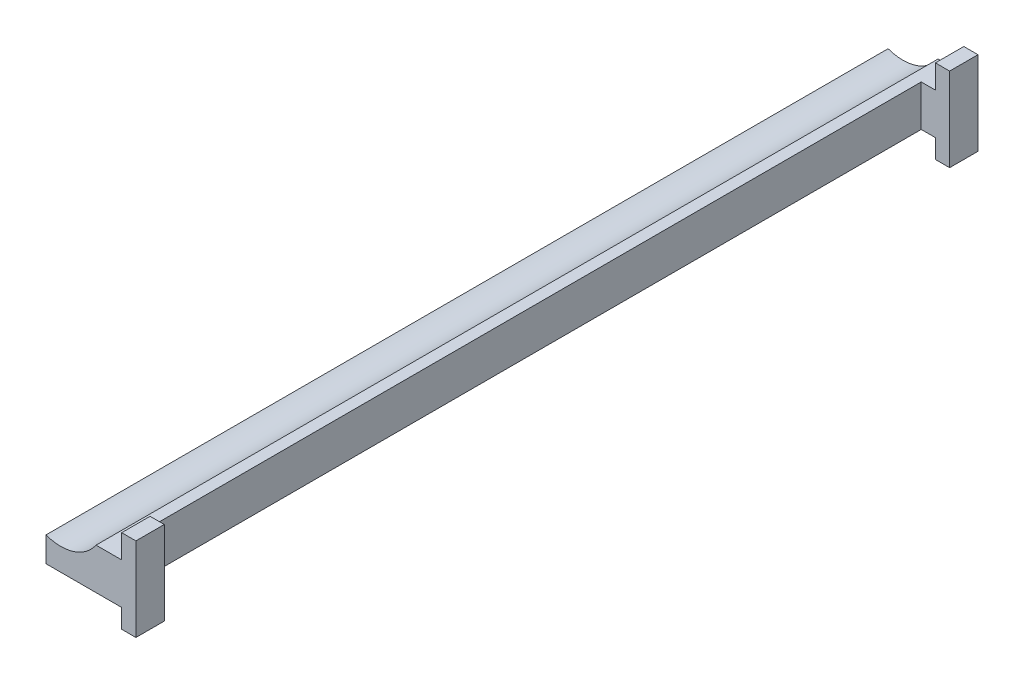
ISO-10303-21;
HEADER;
FILE_DESCRIPTION(('STEP AP214'),'2;1');
FILE_NAME('part.step','',(''),(''),'','','');
FILE_SCHEMA(('AUTOMOTIVE_DESIGN { 1 0 10303 214 1 1 1 1 }'));
ENDSEC;
DATA;
#1=APPLICATION_CONTEXT('core data for automotive mechanical design processes');
#2=APPLICATION_PROTOCOL_DEFINITION('international standard','automotive_design',2000,#1);
#3=PRODUCT_CONTEXT('',#1,'mechanical');
#4=PRODUCT('Part','Part','',(#3));
#5=PRODUCT_RELATED_PRODUCT_CATEGORY('part','',(#4));
#6=PRODUCT_DEFINITION_FORMATION('','',#4);
#7=PRODUCT_DEFINITION_CONTEXT('part definition',#1,'design');
#8=PRODUCT_DEFINITION('design','',#6,#7);
#9=PRODUCT_DEFINITION_SHAPE('','',#8);
#10=(LENGTH_UNIT() NAMED_UNIT(*) SI_UNIT(.MILLI.,.METRE.));
#11=(NAMED_UNIT(*) PLANE_ANGLE_UNIT() SI_UNIT($,.RADIAN.));
#12=(NAMED_UNIT(*) SI_UNIT($,.STERADIAN.) SOLID_ANGLE_UNIT());
#13=UNCERTAINTY_MEASURE_WITH_UNIT(LENGTH_MEASURE(1.E-05),#10,'distance_accuracy_value','');
#14=(GEOMETRIC_REPRESENTATION_CONTEXT(3) GLOBAL_UNCERTAINTY_ASSIGNED_CONTEXT((#13)) GLOBAL_UNIT_ASSIGNED_CONTEXT((#10,
#11,#12)) REPRESENTATION_CONTEXT('',''));
#15=CARTESIAN_POINT('',(0.,0.,0.));
#16=DIRECTION('',(0.,0.,1.));
#17=DIRECTION('',(1.,0.,0.));
#18=AXIS2_PLACEMENT_3D('',#15,#16,#17);
#19=CARTESIAN_POINT('',(-202.415201488574,0.,-890.));
#20=DIRECTION('',(1.,0.,0.));
#21=DIRECTION('',(0.,0.,-1.));
#22=AXIS2_PLACEMENT_3D('',#19,#20,#21);
#23=PLANE('',#22);
#24=DIRECTION('',(0.,0.,1.));
#25=VECTOR('',#24,1.);
#26=CARTESIAN_POINT('',(-202.415201488574,17.9396139522176,-890.));
#27=LINE('',#26,#25);
#28=CARTESIAN_POINT('',(-202.415201488574,17.9396139522176,-890.));
#29=VERTEX_POINT('',#28);
#30=CARTESIAN_POINT('',(-202.415201488574,17.9396139522176,-860.));
#31=VERTEX_POINT('',#30);
#32=EDGE_CURVE('E204',#29,#31,#27,.T.);
#33=ORIENTED_EDGE('',*,*,#32,.T.);
#34=DIRECTION('',(0.,1.,0.));
#35=VECTOR('',#34,1.);
#36=CARTESIAN_POINT('',(-202.415201488574,0.,-860.));
#37=LINE('',#36,#35);
#38=CARTESIAN_POINT('',(-202.415201488574,42.879994244333,-860.));
#39=VERTEX_POINT('',#38);
#40=EDGE_CURVE('E144',#31,#39,#37,.T.);
#41=ORIENTED_EDGE('',*,*,#40,.T.);
#42=DIRECTION('',(0.,0.,1.));
#43=VECTOR('',#42,1.);
#44=CARTESIAN_POINT('',(-202.415201488574,42.879994244333,-890.));
#45=LINE('',#44,#43);
#46=CARTESIAN_POINT('',(-202.415201488574,42.879994244333,-890.));
#47=VERTEX_POINT('',#46);
#48=EDGE_CURVE('E141',#47,#39,#45,.T.);
#49=ORIENTED_EDGE('',*,*,#48,.F.);
#50=DIRECTION('',(0.,1.,0.));
#51=VECTOR('',#50,1.);
#52=CARTESIAN_POINT('',(-202.415201488574,0.,-890.));
#53=LINE('',#52,#51);
#54=EDGE_CURVE('E129',#29,#47,#53,.T.);
#55=ORIENTED_EDGE('',*,*,#54,.F.);
#56=EDGE_LOOP('',(#33,#41,#49,#55));
#57=FACE_BOUND('',#56,.T.);
#58=ADVANCED_FACE('F41',(#57),#23,.F.);
#59=CARTESIAN_POINT('',(0.,42.879994244333,-890.));
#60=DIRECTION('',(0.,-1.,0.));
#61=DIRECTION('',(0.,0.,-1.));
#62=AXIS2_PLACEMENT_3D('',#59,#60,#61);
#63=PLANE('',#62);
#64=ORIENTED_EDGE('',*,*,#48,.T.);
#65=DIRECTION('',(1.,0.,0.));
#66=VECTOR('',#65,1.);
#67=CARTESIAN_POINT('',(-217.415201488574,42.879994244333,-860.));
#68=LINE('',#67,#66);
#69=CARTESIAN_POINT('',(-187.415201488574,42.879994244333,-860.));
#70=VERTEX_POINT('',#69);
#71=EDGE_CURVE('E305',#39,#70,#68,.T.);
#72=ORIENTED_EDGE('',*,*,#71,.T.);
#73=DIRECTION('',(0.,0.,1.));
#74=VECTOR('',#73,1.);
#75=CARTESIAN_POINT('',(-187.415201488574,42.879994244333,-890.));
#76=LINE('',#75,#74);
#77=CARTESIAN_POINT('',(-187.415201488574,42.879994244333,-890.));
#78=VERTEX_POINT('',#77);
#79=EDGE_CURVE('E153',#78,#70,#76,.T.);
#80=ORIENTED_EDGE('',*,*,#79,.F.);
#81=DIRECTION('',(1.,0.,0.));
#82=VECTOR('',#81,1.);
#83=CARTESIAN_POINT('',(0.,42.879994244333,-890.));
#84=LINE('',#83,#82);
#85=EDGE_CURVE('E133',#47,#78,#84,.T.);
#86=ORIENTED_EDGE('',*,*,#85,.F.);
#87=EDGE_LOOP('',(#64,#72,#80,#86));
#88=FACE_BOUND('',#87,.T.);
#89=ADVANCED_FACE('F151',(#88),#63,.F.);
#90=CARTESIAN_POINT('',(-187.415201488574,0.,-890.));
#91=DIRECTION('',(-1.,0.,0.));
#92=DIRECTION('',(0.,0.,1.));
#93=AXIS2_PLACEMENT_3D('',#90,#91,#92);
#94=PLANE('',#93);
#95=ORIENTED_EDGE('',*,*,#79,.T.);
#96=DIRECTION('',(0.,1.,0.));
#97=VECTOR('',#96,1.);
#98=CARTESIAN_POINT('',(-187.415201488574,-45.5622701416247,-860.));
#99=LINE('',#98,#97);
#100=CARTESIAN_POINT('',(-187.415201488574,-45.5622701416247,-860.));
#101=VERTEX_POINT('',#100);
#102=EDGE_CURVE('E356',#101,#70,#99,.T.);
#103=ORIENTED_EDGE('',*,*,#102,.F.);
#104=DIRECTION('',(0.,0.,1.));
#105=VECTOR('',#104,1.);
#106=CARTESIAN_POINT('',(-187.415201488574,-45.5622701416248,-890.));
#107=LINE('',#106,#105);
#108=CARTESIAN_POINT('',(-187.415201488574,-45.5622701416248,-890.));
#109=VERTEX_POINT('',#108);
#110=EDGE_CURVE('E210',#109,#101,#107,.T.);
#111=ORIENTED_EDGE('',*,*,#110,.F.);
#112=DIRECTION('',(0.,-1.,0.));
#113=VECTOR('',#112,1.);
#114=CARTESIAN_POINT('',(-187.415201488574,0.,-890.));
#115=LINE('',#114,#113);
#116=EDGE_CURVE('E156',#78,#109,#115,.T.);
#117=ORIENTED_EDGE('',*,*,#116,.F.);
#118=EDGE_LOOP('',(#95,#103,#111,#117));
#119=FACE_BOUND('',#118,.T.);
#120=ADVANCED_FACE('F393',(#119),#94,.F.);
#121=CARTESIAN_POINT('',(0.,-45.5622701416248,-890.));
#122=DIRECTION('',(0.,1.,0.));
#123=DIRECTION('',(0.,0.,1.));
#124=AXIS2_PLACEMENT_3D('',#121,#122,#123);
#125=PLANE('',#124);
#126=ORIENTED_EDGE('',*,*,#110,.T.);
#127=DIRECTION('',(1.,0.,0.));
#128=VECTOR('',#127,1.);
#129=CARTESIAN_POINT('',(-217.415201488574,-45.5622701416247,-860.));
#130=LINE('',#129,#128);
#131=CARTESIAN_POINT('',(-202.415201488574,-45.5622701416247,-860.));
#132=VERTEX_POINT('',#131);
#133=EDGE_CURVE('E333',#132,#101,#130,.T.);
#134=ORIENTED_EDGE('',*,*,#133,.F.);
#135=DIRECTION('',(0.,0.,1.));
#136=VECTOR('',#135,1.);
#137=CARTESIAN_POINT('',(-202.415201488574,-45.5622701416248,-890.));
#138=LINE('',#137,#136);
#139=CARTESIAN_POINT('',(-202.415201488574,-45.5622701416248,-890.));
#140=VERTEX_POINT('',#139);
#141=EDGE_CURVE('E215',#140,#132,#138,.T.);
#142=ORIENTED_EDGE('',*,*,#141,.F.);
#143=DIRECTION('',(-1.,0.,0.));
#144=VECTOR('',#143,1.);
#145=CARTESIAN_POINT('',(0.,-45.5622701416248,-890.));
#146=LINE('',#145,#144);
#147=EDGE_CURVE('E159',#109,#140,#146,.T.);
#148=ORIENTED_EDGE('',*,*,#147,.F.);
#149=EDGE_LOOP('',(#126,#134,#142,#148));
#150=FACE_BOUND('',#149,.T.);
#151=ADVANCED_FACE('F331',(#150),#125,.F.);
#152=CARTESIAN_POINT('',(-202.415201488574,0.,-890.));
#153=DIRECTION('',(1.,0.,0.));
#154=DIRECTION('',(0.,0.,-1.));
#155=AXIS2_PLACEMENT_3D('',#152,#153,#154);
#156=PLANE('',#155);
#157=ORIENTED_EDGE('',*,*,#141,.T.);
#158=DIRECTION('',(0.,1.,0.));
#159=VECTOR('',#158,1.);
#160=CARTESIAN_POINT('',(-202.415201488574,0.,-860.));
#161=LINE('',#160,#159);
#162=CARTESIAN_POINT('',(-202.415201488574,-25.5622701416248,-860.));
#163=VERTEX_POINT('',#162);
#164=EDGE_CURVE('E307',#132,#163,#161,.T.);
#165=ORIENTED_EDGE('',*,*,#164,.T.);
#166=DIRECTION('',(0.,0.,1.));
#167=VECTOR('',#166,1.);
#168=CARTESIAN_POINT('',(-202.415201488574,-25.5622701416248,-890.));
#169=LINE('',#168,#167);
#170=CARTESIAN_POINT('',(-202.415201488574,-25.5622701416248,-890.));
#171=VERTEX_POINT('',#170);
#172=EDGE_CURVE('E220',#171,#163,#169,.T.);
#173=ORIENTED_EDGE('',*,*,#172,.F.);
#174=DIRECTION('',(0.,1.,0.));
#175=VECTOR('',#174,1.);
#176=CARTESIAN_POINT('',(-202.415201488574,0.,-890.));
#177=LINE('',#176,#175);
#178=EDGE_CURVE('E321',#140,#171,#177,.T.);
#179=ORIENTED_EDGE('',*,*,#178,.F.);
#180=EDGE_LOOP('',(#157,#165,#173,#179));
#181=FACE_BOUND('',#180,.T.);
#182=ADVANCED_FACE('F335',(#181),#156,.F.);
#183=CARTESIAN_POINT('',(-266.85,43.0904288512691,-890.));
#184=DIRECTION('',(0.,0.,1.));
#185=DIRECTION('',(1.,0.,0.));
#186=AXIS2_PLACEMENT_3D('',#183,#184,#185);
#187=CYLINDRICAL_SURFACE('',#186,45.);
#188=CARTESIAN_POINT('',(-266.85,43.0904288512691,0.));
#189=DIRECTION('',(0.,0.,1.));
#190=DIRECTION('',(1.,0.,0.));
#191=AXIS2_PLACEMENT_3D('',#188,#189,#190);
#192=CIRCLE('',#191,45.);
#193=CARTESIAN_POINT('',(-282.415201488574,0.868106525038631,0.));
#194=VERTEX_POINT('',#193);
#195=CARTESIAN_POINT('',(-229.534634399303,17.9396139522176,0.));
#196=VERTEX_POINT('',#195);
#197=EDGE_CURVE('E166',#194,#196,#192,.T.);
#198=ORIENTED_EDGE('',*,*,#197,.T.);
#199=DIRECTION('',(0.,0.,1.));
#200=VECTOR('',#199,1.);
#201=CARTESIAN_POINT('',(-229.534634399303,17.9396139522176,-890.));
#202=LINE('',#201,#200);
#203=CARTESIAN_POINT('',(-229.534634399303,17.9396139522176,-890.));
#204=VERTEX_POINT('',#203);
#205=EDGE_CURVE('E200',#204,#196,#202,.T.);
#206=ORIENTED_EDGE('',*,*,#205,.F.);
#207=CARTESIAN_POINT('',(-266.85,43.0904288512691,-890.));
#208=DIRECTION('',(0.,0.,1.));
#209=DIRECTION('',(1.,0.,0.));
#210=AXIS2_PLACEMENT_3D('',#207,#208,#209);
#211=CIRCLE('',#210,45.);
#212=CARTESIAN_POINT('',(-282.415201488574,0.868106525038631,-890.));
#213=VERTEX_POINT('',#212);
#214=EDGE_CURVE('E199',#213,#204,#211,.T.);
#215=ORIENTED_EDGE('',*,*,#214,.F.);
#216=DIRECTION('',(0.,0.,1.));
#217=VECTOR('',#216,1.);
#218=CARTESIAN_POINT('',(-282.415201488574,0.868106525038631,-890.));
#219=LINE('',#218,#217);
#220=EDGE_CURVE('E165',#213,#194,#219,.T.);
#221=ORIENTED_EDGE('',*,*,#220,.T.);
#222=EDGE_LOOP('',(#198,#206,#215,#221));
#223=FACE_BOUND('',#222,.T.);
#224=ADVANCED_FACE('F43',(#223),#187,.F.);
#225=CARTESIAN_POINT('',(0.,17.9396139522176,-890.));
#226=DIRECTION('',(0.,-1.,0.));
#227=DIRECTION('',(0.,0.,-1.));
#228=AXIS2_PLACEMENT_3D('',#225,#226,#227);
#229=PLANE('',#228);
#230=DIRECTION('',(0.,0.,1.));
#231=VECTOR('',#230,1.);
#232=CARTESIAN_POINT('',(-217.415201488574,17.9396139522176,-890.));
#233=LINE('',#232,#231);
#234=CARTESIAN_POINT('',(-217.415201488574,17.9396139522176,-860.));
#235=VERTEX_POINT('',#234);
#236=CARTESIAN_POINT('',(-217.415201488574,17.9396139522176,-30.));
#237=VERTEX_POINT('',#236);
#238=EDGE_CURVE('E309',#235,#237,#233,.T.);
#239=ORIENTED_EDGE('',*,*,#238,.F.);
#240=DIRECTION('',(1.,0.,0.));
#241=VECTOR('',#240,1.);
#242=CARTESIAN_POINT('',(0.,17.9396139522176,-860.));
#243=LINE('',#242,#241);
#244=EDGE_CURVE('E171',#235,#31,#243,.T.);
#245=ORIENTED_EDGE('',*,*,#244,.T.);
#246=ORIENTED_EDGE('',*,*,#32,.F.);
#247=DIRECTION('',(1.,0.,0.));
#248=VECTOR('',#247,1.);
#249=CARTESIAN_POINT('',(0.,17.9396139522176,-890.));
#250=LINE('',#249,#248);
#251=EDGE_CURVE('E66',#204,#29,#250,.T.);
#252=ORIENTED_EDGE('',*,*,#251,.F.);
#253=ORIENTED_EDGE('',*,*,#205,.T.);
#254=DIRECTION('',(1.,0.,0.));
#255=VECTOR('',#254,1.);
#256=CARTESIAN_POINT('',(0.,17.9396139522176,0.));
#257=LINE('',#256,#255);
#258=CARTESIAN_POINT('',(-202.415201488574,17.9396139522176,0.));
#259=VERTEX_POINT('',#258);
#260=EDGE_CURVE('E103',#196,#259,#257,.T.);
#261=ORIENTED_EDGE('',*,*,#260,.T.);
#262=CARTESIAN_POINT('',(-202.415201488574,17.9396139522176,-30.));
#263=VERTEX_POINT('',#262);
#264=EDGE_CURVE('E148',#263,#259,#27,.T.);
#265=ORIENTED_EDGE('',*,*,#264,.F.);
#266=DIRECTION('',(-1.,0.,0.));
#267=VECTOR('',#266,1.);
#268=CARTESIAN_POINT('',(0.,17.9396139522176,-30.));
#269=LINE('',#268,#267);
#270=EDGE_CURVE('E378',#263,#237,#269,.T.);
#271=ORIENTED_EDGE('',*,*,#270,.T.);
#272=EDGE_LOOP('',(#239,#245,#246,#252,#253,#261,#265,#271));
#273=FACE_BOUND('',#272,.T.);
#274=ADVANCED_FACE('F268',(#273),#229,.F.);
#275=CARTESIAN_POINT('',(-202.415201488574,42.879994244333,-30.));
#276=VERTEX_POINT('',#275);
#277=CARTESIAN_POINT('',(-202.415201488574,42.879994244333,0.));
#278=VERTEX_POINT('',#277);
#279=EDGE_CURVE('E149',#276,#278,#45,.T.);
#280=ORIENTED_EDGE('',*,*,#279,.F.);
#281=DIRECTION('',(0.,-1.,0.));
#282=VECTOR('',#281,1.);
#283=CARTESIAN_POINT('',(-202.415201488574,-1.01209226133988E-13,-30.));
#284=LINE('',#283,#282);
#285=EDGE_CURVE('E265',#276,#263,#284,.T.);
#286=ORIENTED_EDGE('',*,*,#285,.T.);
#287=ORIENTED_EDGE('',*,*,#264,.T.);
#288=DIRECTION('',(0.,1.,0.));
#289=VECTOR('',#288,1.);
#290=CARTESIAN_POINT('',(-202.415201488574,0.,0.));
#291=LINE('',#290,#289);
#292=EDGE_CURVE('E193',#259,#278,#291,.T.);
#293=ORIENTED_EDGE('',*,*,#292,.T.);
#294=EDGE_LOOP('',(#280,#286,#287,#293));
#295=FACE_BOUND('',#294,.T.);
#296=ADVANCED_FACE('F262',(#295),#23,.F.);
#297=CARTESIAN_POINT('',(-187.415201488574,42.879994244333,-30.));
#298=VERTEX_POINT('',#297);
#299=CARTESIAN_POINT('',(-187.415201488574,42.879994244333,0.));
#300=VERTEX_POINT('',#299);
#301=EDGE_CURVE('E209',#298,#300,#76,.T.);
#302=ORIENTED_EDGE('',*,*,#301,.F.);
#303=DIRECTION('',(1.,0.,0.));
#304=VECTOR('',#303,1.);
#305=CARTESIAN_POINT('',(-217.415201488574,42.879994244333,-30.));
#306=LINE('',#305,#304);
#307=EDGE_CURVE('E280',#276,#298,#306,.T.);
#308=ORIENTED_EDGE('',*,*,#307,.F.);
#309=ORIENTED_EDGE('',*,*,#279,.T.);
#310=DIRECTION('',(1.,0.,0.));
#311=VECTOR('',#310,1.);
#312=CARTESIAN_POINT('',(0.,42.879994244333,0.));
#313=LINE('',#312,#311);
#314=EDGE_CURVE('E189',#278,#300,#313,.T.);
#315=ORIENTED_EDGE('',*,*,#314,.T.);
#316=EDGE_LOOP('',(#302,#308,#309,#315));
#317=FACE_BOUND('',#316,.T.);
#318=ADVANCED_FACE('F275',(#317),#63,.F.);
#319=CARTESIAN_POINT('',(-187.415201488574,-45.5622701416248,-30.));
#320=VERTEX_POINT('',#319);
#321=CARTESIAN_POINT('',(-187.415201488574,-45.5622701416248,0.));
#322=VERTEX_POINT('',#321);
#323=EDGE_CURVE('E214',#320,#322,#107,.T.);
#324=ORIENTED_EDGE('',*,*,#323,.F.);
#325=DIRECTION('',(0.,-1.,0.));
#326=VECTOR('',#325,1.);
#327=CARTESIAN_POINT('',(-187.415201488574,42.879994244333,-30.));
#328=LINE('',#327,#326);
#329=EDGE_CURVE('E353',#298,#320,#328,.T.);
#330=ORIENTED_EDGE('',*,*,#329,.F.);
#331=ORIENTED_EDGE('',*,*,#301,.T.);
#332=DIRECTION('',(0.,-1.,0.));
#333=VECTOR('',#332,1.);
#334=CARTESIAN_POINT('',(-187.415201488574,0.,0.));
#335=LINE('',#334,#333);
#336=EDGE_CURVE('E185',#300,#322,#335,.T.);
#337=ORIENTED_EDGE('',*,*,#336,.T.);
#338=EDGE_LOOP('',(#324,#330,#331,#337));
#339=FACE_BOUND('',#338,.T.);
#340=ADVANCED_FACE('F351',(#339),#94,.F.);
#341=CARTESIAN_POINT('',(-202.415201488574,-45.5622701416248,-30.));
#342=VERTEX_POINT('',#341);
#343=CARTESIAN_POINT('',(-202.415201488574,-45.5622701416248,0.));
#344=VERTEX_POINT('',#343);
#345=EDGE_CURVE('E219',#342,#344,#138,.T.);
#346=ORIENTED_EDGE('',*,*,#345,.F.);
#347=DIRECTION('',(1.,0.,0.));
#348=VECTOR('',#347,1.);
#349=CARTESIAN_POINT('',(-217.415201488574,-45.5622701416248,-30.));
#350=LINE('',#349,#348);
#351=EDGE_CURVE('E348',#342,#320,#350,.T.);
#352=ORIENTED_EDGE('',*,*,#351,.T.);
#353=ORIENTED_EDGE('',*,*,#323,.T.);
#354=DIRECTION('',(-1.,0.,0.));
#355=VECTOR('',#354,1.);
#356=CARTESIAN_POINT('',(0.,-45.5622701416248,0.));
#357=LINE('',#356,#355);
#358=EDGE_CURVE('E181',#322,#344,#357,.T.);
#359=ORIENTED_EDGE('',*,*,#358,.T.);
#360=EDGE_LOOP('',(#346,#352,#353,#359));
#361=FACE_BOUND('',#360,.T.);
#362=ADVANCED_FACE('F344',(#361),#125,.F.);
#363=CARTESIAN_POINT('',(-202.415201488574,-25.5622701416248,-30.));
#364=VERTEX_POINT('',#363);
#365=CARTESIAN_POINT('',(-202.415201488574,-25.5622701416248,0.));
#366=VERTEX_POINT('',#365);
#367=EDGE_CURVE('E224',#364,#366,#169,.T.);
#368=ORIENTED_EDGE('',*,*,#367,.F.);
#369=DIRECTION('',(0.,-1.,0.));
#370=VECTOR('',#369,1.);
#371=CARTESIAN_POINT('',(-202.415201488574,-1.01209226133988E-13,-30.));
#372=LINE('',#371,#370);
#373=EDGE_CURVE('E248',#364,#342,#372,.T.);
#374=ORIENTED_EDGE('',*,*,#373,.T.);
#375=ORIENTED_EDGE('',*,*,#345,.T.);
#376=DIRECTION('',(0.,1.,0.));
#377=VECTOR('',#376,1.);
#378=CARTESIAN_POINT('',(-202.415201488574,0.,0.));
#379=LINE('',#378,#377);
#380=EDGE_CURVE('E177',#344,#366,#379,.T.);
#381=ORIENTED_EDGE('',*,*,#380,.T.);
#382=EDGE_LOOP('',(#368,#374,#375,#381));
#383=FACE_BOUND('',#382,.T.);
#384=ADVANCED_FACE('F247',(#383),#156,.F.);
#385=CARTESIAN_POINT('',(0.,-25.5622701416248,-890.));
#386=DIRECTION('',(0.,1.,0.));
#387=DIRECTION('',(-1.,0.,0.));
#388=AXIS2_PLACEMENT_3D('',#385,#386,#387);
#389=PLANE('',#388);
#390=ORIENTED_EDGE('',*,*,#172,.T.);
#391=DIRECTION('',(-1.,0.,0.));
#392=VECTOR('',#391,1.);
#393=CARTESIAN_POINT('',(0.,-25.5622701416248,-860.));
#394=LINE('',#393,#392);
#395=CARTESIAN_POINT('',(-217.415201488574,-25.5622701416248,-860.));
#396=VERTEX_POINT('',#395);
#397=EDGE_CURVE('E11',#163,#396,#394,.T.);
#398=ORIENTED_EDGE('',*,*,#397,.T.);
#399=DIRECTION('',(0.,0.,-1.));
#400=VECTOR('',#399,1.);
#401=CARTESIAN_POINT('',(-217.415201488574,-25.5622701416248,-890.));
#402=LINE('',#401,#400);
#403=CARTESIAN_POINT('',(-217.415201488574,-25.5622701416248,-30.));
#404=VERTEX_POINT('',#403);
#405=EDGE_CURVE('E203',#404,#396,#402,.T.);
#406=ORIENTED_EDGE('',*,*,#405,.F.);
#407=DIRECTION('',(1.,0.,0.));
#408=VECTOR('',#407,1.);
#409=CARTESIAN_POINT('',(0.,-25.5622701416248,-30.));
#410=LINE('',#409,#408);
#411=EDGE_CURVE('E50',#404,#364,#410,.T.);
#412=ORIENTED_EDGE('',*,*,#411,.T.);
#413=ORIENTED_EDGE('',*,*,#367,.T.);
#414=DIRECTION('',(-1.,0.,0.));
#415=VECTOR('',#414,1.);
#416=CARTESIAN_POINT('',(0.,-25.5622701416248,0.));
#417=LINE('',#416,#415);
#418=CARTESIAN_POINT('',(-282.415201488574,-25.5622701416248,0.));
#419=VERTEX_POINT('',#418);
#420=EDGE_CURVE('E174',#366,#419,#417,.T.);
#421=ORIENTED_EDGE('',*,*,#420,.T.);
#422=DIRECTION('',(0.,0.,1.));
#423=VECTOR('',#422,1.);
#424=CARTESIAN_POINT('',(-282.415201488574,-25.5622701416248,-890.));
#425=LINE('',#424,#423);
#426=CARTESIAN_POINT('',(-282.415201488574,-25.5622701416248,-890.));
#427=VERTEX_POINT('',#426);
#428=EDGE_CURVE('E225',#427,#419,#425,.T.);
#429=ORIENTED_EDGE('',*,*,#428,.F.);
#430=DIRECTION('',(-1.,0.,0.));
#431=VECTOR('',#430,1.);
#432=CARTESIAN_POINT('',(0.,-25.5622701416248,-890.));
#433=LINE('',#432,#431);
#434=EDGE_CURVE('E318',#171,#427,#433,.T.);
#435=ORIENTED_EDGE('',*,*,#434,.F.);
#436=EDGE_LOOP('',(#390,#398,#406,#412,#413,#421,#429,#435));
#437=FACE_BOUND('',#436,.T.);
#438=ADVANCED_FACE('F239',(#437),#389,.F.);
#439=CARTESIAN_POINT('',(-282.415201488574,0.,-890.));
#440=DIRECTION('',(1.,0.,0.));
#441=DIRECTION('',(0.,0.,-1.));
#442=AXIS2_PLACEMENT_3D('',#439,#440,#441);
#443=PLANE('',#442);
#444=DIRECTION('',(0.,1.,0.));
#445=VECTOR('',#444,1.);
#446=CARTESIAN_POINT('',(-282.415201488574,0.,0.));
#447=LINE('',#446,#445);
#448=EDGE_CURVE('E170',#419,#194,#447,.T.);
#449=ORIENTED_EDGE('',*,*,#448,.T.);
#450=ORIENTED_EDGE('',*,*,#220,.F.);
#451=DIRECTION('',(0.,1.,0.));
#452=VECTOR('',#451,1.);
#453=CARTESIAN_POINT('',(-282.415201488574,0.,-890.));
#454=LINE('',#453,#452);
#455=EDGE_CURVE('E110',#427,#213,#454,.T.);
#456=ORIENTED_EDGE('',*,*,#455,.F.);
#457=ORIENTED_EDGE('',*,*,#428,.T.);
#458=EDGE_LOOP('',(#449,#450,#456,#457));
#459=FACE_BOUND('',#458,.T.);
#460=ADVANCED_FACE('F340',(#459),#443,.F.);
#461=CARTESIAN_POINT('',(0.,0.,-890.));
#462=DIRECTION('',(0.,0.,1.));
#463=DIRECTION('',(1.,0.,0.));
#464=AXIS2_PLACEMENT_3D('',#461,#462,#463);
#465=PLANE('',#464);
#466=ORIENTED_EDGE('',*,*,#214,.T.);
#467=ORIENTED_EDGE('',*,*,#251,.T.);
#468=ORIENTED_EDGE('',*,*,#54,.T.);
#469=ORIENTED_EDGE('',*,*,#85,.T.);
#470=ORIENTED_EDGE('',*,*,#116,.T.);
#471=ORIENTED_EDGE('',*,*,#147,.T.);
#472=ORIENTED_EDGE('',*,*,#178,.T.);
#473=ORIENTED_EDGE('',*,*,#434,.T.);
#474=ORIENTED_EDGE('',*,*,#455,.T.);
#475=EDGE_LOOP('',(#466,#467,#468,#469,#470,#471,#472,#473,#474));
#476=FACE_BOUND('',#475,.T.);
#477=ADVANCED_FACE('F131',(#476),#465,.F.);
#478=CARTESIAN_POINT('',(0.,0.,0.));
#479=DIRECTION('',(0.,0.,1.));
#480=DIRECTION('',(1.,0.,0.));
#481=AXIS2_PLACEMENT_3D('',#478,#479,#480);
#482=PLANE('',#481);
#483=ORIENTED_EDGE('',*,*,#197,.F.);
#484=ORIENTED_EDGE('',*,*,#448,.F.);
#485=ORIENTED_EDGE('',*,*,#420,.F.);
#486=ORIENTED_EDGE('',*,*,#380,.F.);
#487=ORIENTED_EDGE('',*,*,#358,.F.);
#488=ORIENTED_EDGE('',*,*,#336,.F.);
#489=ORIENTED_EDGE('',*,*,#314,.F.);
#490=ORIENTED_EDGE('',*,*,#292,.F.);
#491=ORIENTED_EDGE('',*,*,#260,.F.);
#492=EDGE_LOOP('',(#483,#484,#485,#486,#487,#488,#489,#490,#491));
#493=FACE_BOUND('',#492,.T.);
#494=ADVANCED_FACE('F270',(#493),#482,.T.);
#495=CARTESIAN_POINT('',(-217.415201488574,-45.5622701416247,-860.));
#496=DIRECTION('',(0.,0.,-1.));
#497=DIRECTION('',(-1.,0.,0.));
#498=AXIS2_PLACEMENT_3D('',#495,#496,#497);
#499=PLANE('',#498);
#500=DIRECTION('',(0.,1.,0.));
#501=VECTOR('',#500,1.);
#502=CARTESIAN_POINT('',(-217.415201488574,-45.5622701416247,-860.));
#503=LINE('',#502,#501);
#504=EDGE_CURVE('E361',#396,#235,#503,.T.);
#505=ORIENTED_EDGE('',*,*,#504,.F.);
#506=ORIENTED_EDGE('',*,*,#397,.F.);
#507=ORIENTED_EDGE('',*,*,#164,.F.);
#508=ORIENTED_EDGE('',*,*,#133,.T.);
#509=ORIENTED_EDGE('',*,*,#102,.T.);
#510=ORIENTED_EDGE('',*,*,#71,.F.);
#511=ORIENTED_EDGE('',*,*,#40,.F.);
#512=ORIENTED_EDGE('',*,*,#244,.F.);
#513=EDGE_LOOP('',(#505,#506,#507,#508,#509,#510,#511,#512));
#514=FACE_BOUND('',#513,.T.);
#515=ADVANCED_FACE('F302',(#514),#499,.F.);
#516=CARTESIAN_POINT('',(-217.415201488574,42.879994244333,-30.));
#517=DIRECTION('',(0.,0.,1.));
#518=DIRECTION('',(0.,-1.,0.));
#519=AXIS2_PLACEMENT_3D('',#516,#517,#518);
#520=PLANE('',#519);
#521=ORIENTED_EDGE('',*,*,#285,.F.);
#522=ORIENTED_EDGE('',*,*,#307,.T.);
#523=ORIENTED_EDGE('',*,*,#329,.T.);
#524=ORIENTED_EDGE('',*,*,#351,.F.);
#525=ORIENTED_EDGE('',*,*,#373,.F.);
#526=ORIENTED_EDGE('',*,*,#411,.F.);
#527=DIRECTION('',(0.,-1.,0.));
#528=VECTOR('',#527,1.);
#529=CARTESIAN_POINT('',(-217.415201488574,42.879994244333,-30.));
#530=LINE('',#529,#528);
#531=EDGE_CURVE('E57',#237,#404,#530,.T.);
#532=ORIENTED_EDGE('',*,*,#531,.F.);
#533=ORIENTED_EDGE('',*,*,#270,.F.);
#534=EDGE_LOOP('',(#521,#522,#523,#524,#525,#526,#532,#533));
#535=FACE_BOUND('',#534,.T.);
#536=ADVANCED_FACE('F421',(#535),#520,.F.);
#537=CARTESIAN_POINT('',(-217.415201488574,0.,0.));
#538=DIRECTION('',(1.,0.,0.));
#539=DIRECTION('',(0.,0.,-1.));
#540=AXIS2_PLACEMENT_3D('',#537,#538,#539);
#541=PLANE('',#540);
#542=ORIENTED_EDGE('',*,*,#238,.T.);
#543=ORIENTED_EDGE('',*,*,#531,.T.);
#544=ORIENTED_EDGE('',*,*,#405,.T.);
#545=ORIENTED_EDGE('',*,*,#504,.T.);
#546=EDGE_LOOP('',(#542,#543,#544,#545));
#547=FACE_BOUND('',#546,.T.);
#548=ADVANCED_FACE('F383',(#547),#541,.T.);
#549=CLOSED_SHELL('',(#58,#89,#120,#151,#182,#224,#274,#296,#318,#340,#362,#384,#438,#460,#477,
#494,#515,#536,#548));
#550=MANIFOLD_SOLID_BREP('B2',#549);
#551=ADVANCED_BREP_SHAPE_REPRESENTATION('',(#18,#550),#14);
#552=SHAPE_DEFINITION_REPRESENTATION(#9,#551);
ENDSEC;
END-ISO-10303-21;
